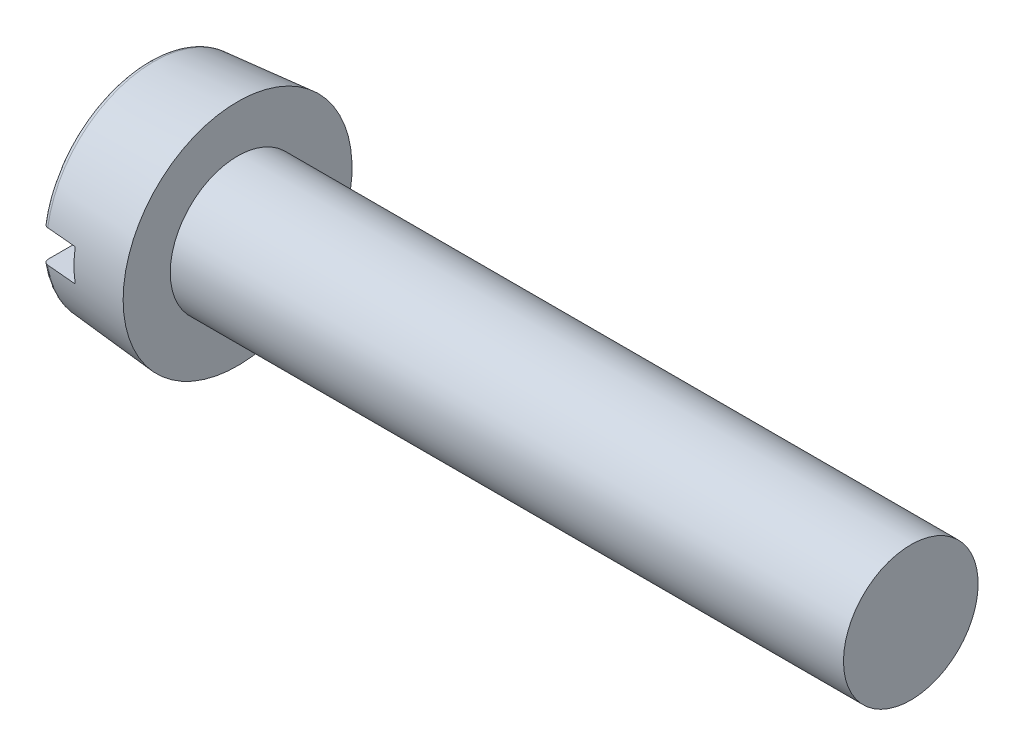
ISO-10303-21;
HEADER;
FILE_DESCRIPTION(('STEP AP214'),'2;1');
FILE_NAME('part.step','',(''),(''),'','','');
FILE_SCHEMA(('AUTOMOTIVE_DESIGN { 1 0 10303 214 1 1 1 1 }'));
ENDSEC;
DATA;
#1=APPLICATION_CONTEXT('core data for automotive mechanical design processes');
#2=APPLICATION_PROTOCOL_DEFINITION('international standard','automotive_design',2000,#1);
#3=PRODUCT_CONTEXT('',#1,'mechanical');
#4=PRODUCT('Part','Part','',(#3));
#5=PRODUCT_RELATED_PRODUCT_CATEGORY('part','',(#4));
#6=PRODUCT_DEFINITION_FORMATION('','',#4);
#7=PRODUCT_DEFINITION_CONTEXT('part definition',#1,'design');
#8=PRODUCT_DEFINITION('design','',#6,#7);
#9=PRODUCT_DEFINITION_SHAPE('','',#8);
#10=(LENGTH_UNIT() NAMED_UNIT(*) SI_UNIT(.MILLI.,.METRE.));
#11=(NAMED_UNIT(*) PLANE_ANGLE_UNIT() SI_UNIT($,.RADIAN.));
#12=(NAMED_UNIT(*) SI_UNIT($,.STERADIAN.) SOLID_ANGLE_UNIT());
#13=UNCERTAINTY_MEASURE_WITH_UNIT(LENGTH_MEASURE(1.E-05),#10,'distance_accuracy_value','');
#14=(GEOMETRIC_REPRESENTATION_CONTEXT(3) GLOBAL_UNCERTAINTY_ASSIGNED_CONTEXT((#13)) GLOBAL_UNIT_ASSIGNED_CONTEXT((#10,
#11,#12)) REPRESENTATION_CONTEXT('',''));
#15=CARTESIAN_POINT('',(0.,0.,0.));
#16=DIRECTION('',(0.,0.,1.));
#17=DIRECTION('',(1.,0.,0.));
#18=AXIS2_PLACEMENT_3D('',#15,#16,#17);
#19=CARTESIAN_POINT('',(0.,0.,0.));
#20=DIRECTION('',(-1.,0.,0.));
#21=DIRECTION('',(0.,0.,1.));
#22=AXIS2_PLACEMENT_3D('',#19,#20,#21);
#23=PLANE('',#22);
#24=DIRECTION('',(0.,0.,-1.));
#25=VECTOR('',#24,1.);
#26=CARTESIAN_POINT('',(0.,0.6,4.25));
#27=LINE('',#26,#25);
#28=CARTESIAN_POINT('',(0.,0.6,3.7300729219396));
#29=VERTEX_POINT('',#28);
#30=CARTESIAN_POINT('',(0.,0.6,-3.7300729219396));
#31=VERTEX_POINT('',#30);
#32=EDGE_CURVE('E109',#29,#31,#27,.T.);
#33=ORIENTED_EDGE('',*,*,#32,.F.);
#34=CARTESIAN_POINT('',(0.,0.,0.));
#35=DIRECTION('',(-1.,0.,0.));
#36=DIRECTION('',(0.,0.,1.));
#37=AXIS2_PLACEMENT_3D('',#34,#35,#36);
#38=CIRCLE('',#37,3.77802117556097);
#39=EDGE_CURVE('E111',#29,#31,#38,.T.);
#40=ORIENTED_EDGE('',*,*,#39,.T.);
#41=EDGE_LOOP('',(#33,#40));
#42=FACE_BOUND('',#41,.T.);
#43=ADVANCED_FACE('F40',(#42),#23,.T.);
#44=CARTESIAN_POINT('',(0.2,0.,0.));
#45=DIRECTION('',(-1.,0.,0.));
#46=DIRECTION('',(0.,0.,1.));
#47=AXIS2_PLACEMENT_3D('',#44,#45,#46);
#48=TOROIDAL_SURFACE('',#47,3.77802117556097,0.2);
#49=CARTESIAN_POINT('',(0.0612246387865015,0.6,-3.87587372657926));
#50=CARTESIAN_POINT('',(0.0692437686753912,0.6,-3.88369228056032));
#51=CARTESIAN_POINT('',(0.0779233060285452,0.6,-3.89084432861686));
#52=CARTESIAN_POINT('',(0.0963647371093723,0.6,-3.90359892074776));
#53=CARTESIAN_POINT('',(0.106127774849142,0.6,-3.90919980480116));
#54=CARTESIAN_POINT('',(0.126458056502604,0.6,-3.9186779090971));
#55=CARTESIAN_POINT('',(0.137025240149511,0.6,-3.9225552583614));
#56=CARTESIAN_POINT('',(0.158660455760603,0.6,-3.92846742757867));
#57=CARTESIAN_POINT('',(0.169728366633293,0.6,-3.93050269053124));
#58=CARTESIAN_POINT('',(0.191982910164277,0.6,-3.93266377300577));
#59=CARTESIAN_POINT('',(0.203168454374147,0.6,-3.93280080792452));
#60=CARTESIAN_POINT('',(0.22540313842355,0.6,-3.93119011051395));
#61=CARTESIAN_POINT('',(0.236452276636842,0.6,-3.92944235573598));
#62=CARTESIAN_POINT('',(0.258074076113257,0.6,-3.9241213274814));
#63=CARTESIAN_POINT('',(0.268647790704579,0.6,-3.92055233042282));
#64=CARTESIAN_POINT('',(0.289049953276454,0.6,-3.91169791603072));
#65=CARTESIAN_POINT('',(0.29887839185142,0.6,-3.90641247703967));
#66=CARTESIAN_POINT('',(0.317563075466742,0.6,-3.89425210131312));
#67=CARTESIAN_POINT('',(0.326414509930255,0.6,-3.88736977576277));
#68=CARTESIAN_POINT('',(0.342850589250194,0.6,-3.87223027231712));
#69=CARTESIAN_POINT('',(0.350435177228172,0.6,-3.86397303272459));
#70=CARTESIAN_POINT('',(0.364204576611067,0.6,-3.84623083323831));
#71=CARTESIAN_POINT('',(0.370374619979001,0.6,-3.83673441377611));
#72=CARTESIAN_POINT('',(0.381054006931012,0.6,-3.81684980557615));
#73=CARTESIAN_POINT('',(0.385563246202521,0.6,-3.80646156087472));
#74=CARTESIAN_POINT('',(0.392846737104488,0.6,-3.78495964541406));
#75=CARTESIAN_POINT('',(0.395600353250689,0.6,-3.77383898316558));
#76=CARTESIAN_POINT('',(0.399218897141943,0.6,-3.75129442345609));
#77=CARTESIAN_POINT('',(0.400083722775218,0.6,-3.7398705096345));
#78=CARTESIAN_POINT('',(0.399902741791213,0.6,-3.71694103114224));
#79=CARTESIAN_POINT('',(0.398840746719926,0.6,-3.70543559116921));
#80=CARTESIAN_POINT('',(0.394803369378344,0.6,-3.68276514513534));
#81=CARTESIAN_POINT('',(0.391827944203721,0.6,-3.67160014671402));
#82=CARTESIAN_POINT('',(0.384037460739286,0.6,-3.64991355445128));
#83=CARTESIAN_POINT('',(0.379219862757466,0.6,-3.63939287222453));
#84=CARTESIAN_POINT('',(0.367874839392101,0.6,-3.61931729960695));
#85=CARTESIAN_POINT('',(0.361347459439158,0.6,-3.60976238356411));
#86=CARTESIAN_POINT('',(0.346813106724987,0.6,-3.59196475602931));
#87=CARTESIAN_POINT('',(0.338816832744861,0.6,-3.58371331095396));
#88=CARTESIAN_POINT('',(0.321536640605144,0.6,-3.56869120707094));
#89=CARTESIAN_POINT('',(0.312252811605285,0.6,-3.56192044581347));
#90=CARTESIAN_POINT('',(0.292787711529982,0.6,-3.55014520859649));
#91=CARTESIAN_POINT('',(0.282619437412489,0.6,-3.54511924945517));
#92=CARTESIAN_POINT('',(0.261575984908415,0.6,-3.53687075764736));
#93=CARTESIAN_POINT('',(0.250700861851134,0.6,-3.5336480840162));
#94=CARTESIAN_POINT('',(0.228699522013635,0.6,-3.52913644836644));
#95=CARTESIAN_POINT('',(0.217578184290445,0.6,-3.52782367294734));
#96=CARTESIAN_POINT('',(0.195273841652058,0.6,-3.52709644901578));
#97=CARTESIAN_POINT('',(0.184090839563993,0.6,-3.52768191418516));
#98=CARTESIAN_POINT('',(0.162051417581182,0.6,-3.53072340997975));
#99=CARTESIAN_POINT('',(0.151193435259432,0.6,-3.53316814215366));
#100=CARTESIAN_POINT('',(0.130039848472246,0.6,-3.53983958577619));
#101=CARTESIAN_POINT('',(0.119744247211512,0.6,-3.5440663073782));
#102=CARTESIAN_POINT('',(0.0999656304850377,0.6,-3.55419219099659));
#103=CARTESIAN_POINT('',(0.0904856235137145,0.6,-3.56009722590129));
#104=CARTESIAN_POINT('',(0.0726372332701148,0.6,-3.57339845811737));
#105=CARTESIAN_POINT('',(0.0642689096237832,0.6,-3.58079473535911));
#106=CARTESIAN_POINT('',(0.0487797657085489,0.6,-3.59695536738271));
#107=CARTESIAN_POINT('',(0.041673965321641,0.6,-3.60573411527005));
#108=CARTESIAN_POINT('',(0.0290139060780257,0.6,-3.62434680769462));
#109=CARTESIAN_POINT('',(0.0234597605199496,0.6,-3.63418082921323));
#110=CARTESIAN_POINT('',(0.0139840285365265,0.6,-3.6547658519114));
#111=CARTESIAN_POINT('',(0.0100852096750154,0.6,-3.66552733588691));
#112=CARTESIAN_POINT('',(0.00413087259760239,0.6,-3.68754837921726));
#113=CARTESIAN_POINT('',(0.0020753916043561,0.6,-3.69880794862515));
#114=CARTESIAN_POINT('',(-0.0001485685664027,0.6,-3.72161689691355));
#115=CARTESIAN_POINT('',(-0.000299506711232251,0.6,-3.73316798931618));
#116=CARTESIAN_POINT('',(0.00133685743644255,0.6,-3.75613545547462));
#117=CARTESIAN_POINT('',(0.00312467379249925,0.6,-3.76755179268835));
#118=CARTESIAN_POINT('',(0.00859806058197772,0.6,-3.78994282374299));
#119=CARTESIAN_POINT('',(0.0122872838347024,0.6,-3.800916623506));
#120=CARTESIAN_POINT('',(0.0214659155654678,0.6,-3.82207324823008));
#121=CARTESIAN_POINT('',(0.0269531292978248,0.6,-3.83225701890213));
#122=CARTESIAN_POINT('',(0.0372850957105776,0.6,-3.84804615301513));
#123=CARTESIAN_POINT('',(0.0416441542615394,0.6,-3.85397505001525));
#124=CARTESIAN_POINT('',(0.0509821850624984,0.6,-3.86532291935009));
#125=CARTESIAN_POINT('',(0.0559611547765462,0.6,-3.87074189377065));
#126=CARTESIAN_POINT('',(0.0612246387865015,0.6,-3.87587372657926));
#127=B_SPLINE_CURVE_WITH_KNOTS('',3,(#49,#50,#51,#52,#53,#54,#55,#56,#57,#58,#59,#60,#61,#62,
#63,#64,#65,#66,#67,#68,#69,#70,#71,#72,#73,#74,#75,#76,#77,#78,#79,#80,#81,#82,#83,#84,#85,#86,
#87,#88,#89,#90,#91,#92,#93,#94,#95,#96,#97,#98,#99,#100,#101,#102,#103,#104,#105,#106,#107,
#108,#109,#110,#111,#112,#113,#114,#115,#116,#117,#118,#119,#120,#121,#122,#123,#124,#125,#126),
.UNSPECIFIED.,.T.,.F.,(4,2,2,2,2,2,2,2,2,2,2,2,2,2,2,2,2,2,2,2,2,2,2,2,2,2,2,2,2,2,2,2,2,2,2,2,
2,2,4),(0.,0.0335730171484836,0.067181825760315,0.100788118032968,0.134386326247554,
0.16778593922068,0.201185950002037,0.23450789338553,0.267830257231098,0.301309992165475,
0.334791229857928,0.368607534834798,0.402425963400057,0.43663489980734,0.470845685572107,
0.50534523014942,0.539845548327716,0.574393602495696,0.608940738780752,0.643245565962143,
0.677548018811245,0.711411743681506,0.745272821019978,0.778707975040933,0.812141608695966,
0.845373679321568,0.878605939298827,0.911955951073588,0.945307750878941,0.979033047184368,
1.01276080539804,1.04693850769677,1.08111690013278,1.11560985168408,1.15011195132798,
1.18468058187836,1.21920717190366,1.24124344818911,1.26327963433093),.UNSPECIFIED.);
#128=CARTESIAN_POINT('',(0.182568851450474,0.6,-3.93174236488051));
#129=VERTEX_POINT('',#128);
#130=EDGE_CURVE('E64',#31,#129,#127,.T.);
#131=ORIENTED_EDGE('',*,*,#130,.F.);
#132=ORIENTED_EDGE('',*,*,#39,.F.);
#133=CARTESIAN_POINT('',(0.153019204720444,0.6,3.53303185592631));
#134=CARTESIAN_POINT('',(0.163787699092,0.6,3.53039273084238));
#135=CARTESIAN_POINT('',(0.174786369480569,0.6,3.52865997691216));
#136=CARTESIAN_POINT('',(0.196927139373086,0.6,3.52706644904759));
#137=CARTESIAN_POINT('',(0.20806938646626,0.6,3.52720778568122));
#138=CARTESIAN_POINT('',(0.230166793925918,0.6,3.52936085221014));
#139=CARTESIAN_POINT('',(0.241122046646135,0.6,3.53137162989673));
#140=CARTESIAN_POINT('',(0.262537605802998,0.6,3.53719997516225));
#141=CARTESIAN_POINT('',(0.272998019743045,0.6,3.54101714830167));
#142=CARTESIAN_POINT('',(0.293156907074368,0.6,3.55035209768921));
#143=CARTESIAN_POINT('',(0.302853712802607,0.6,3.55587347320583));
#144=CARTESIAN_POINT('',(0.321195782787508,0.6,3.56844988525001));
#145=CARTESIAN_POINT('',(0.329840963247542,0.6,3.5755050438693));
#146=CARTESIAN_POINT('',(0.345933181784514,0.6,3.59102589791574));
#147=CARTESIAN_POINT('',(0.353366652206714,0.6,3.59950565727422));
#148=CARTESIAN_POINT('',(0.366727107894518,0.6,3.61757863289314));
#149=CARTESIAN_POINT('',(0.372653988326806,0.6,3.62717192656921));
#150=CARTESIAN_POINT('',(0.382915984541161,0.6,3.64733777490785));
#151=CARTESIAN_POINT('',(0.387228687602212,0.6,3.65792173686799));
#152=CARTESIAN_POINT('',(0.394036122111021,0.6,3.67965904041595));
#153=CARTESIAN_POINT('',(0.396530745128449,0.6,3.69081241592117));
#154=CARTESIAN_POINT('',(0.399652277896823,0.6,3.71349213245068));
#155=CARTESIAN_POINT('',(0.400260171320127,0.6,3.72502109478211));
#156=CARTESIAN_POINT('',(0.39953720366488,0.6,3.74801834733382));
#157=CARTESIAN_POINT('',(0.398206290301471,0.6,3.7594866359095));
#158=CARTESIAN_POINT('',(0.393633461516549,0.6,3.78206556000447));
#159=CARTESIAN_POINT('',(0.390386850559507,0.6,3.7931752457468));
#160=CARTESIAN_POINT('',(0.382064132667235,0.6,3.8146871645281));
#161=CARTESIAN_POINT('',(0.376988063245644,0.6,3.82508941206812));
#162=CARTESIAN_POINT('',(0.365177274214925,0.6,3.84482560070898));
#163=CARTESIAN_POINT('',(0.358452111344946,0.6,3.85416525859618));
#164=CARTESIAN_POINT('',(0.343513339344314,0.6,3.87156715868567));
#165=CARTESIAN_POINT('',(0.335299812917085,0.6,3.87962947181914));
#166=CARTESIAN_POINT('',(0.317712230470067,0.6,3.89415347977617));
#167=CARTESIAN_POINT('',(0.30835173547522,0.6,3.90063159470799));
#168=CARTESIAN_POINT('',(0.288666107436056,0.6,3.91190330326435));
#169=CARTESIAN_POINT('',(0.278341037742608,0.6,3.91669700741848));
#170=CARTESIAN_POINT('',(0.257144782644673,0.6,3.92440870216056));
#171=CARTESIAN_POINT('',(0.246281069204201,0.6,3.92734723639224));
#172=CARTESIAN_POINT('',(0.224213189898419,0.6,3.93134392354523));
#173=CARTESIAN_POINT('',(0.213009040493183,0.6,3.93240216723189));
#174=CARTESIAN_POINT('',(0.190664464789265,0.6,3.93260524563386));
#175=CARTESIAN_POINT('',(0.179524160616769,0.6,3.93176380416237));
#176=CARTESIAN_POINT('',(0.157543493084992,0.6,3.9282213570788));
#177=CARTESIAN_POINT('',(0.146703125545544,0.6,3.9255203773964));
#178=CARTESIAN_POINT('',(0.125633620376287,0.6,3.91834194214552));
#179=CARTESIAN_POINT('',(0.115404195642637,0.6,3.91386532869004));
#180=CARTESIAN_POINT('',(0.0958356078992517,0.6,3.90326869695395));
#181=CARTESIAN_POINT('',(0.0864964665385028,0.6,3.89714863872356));
#182=CARTESIAN_POINT('',(0.0689078244739585,0.6,3.88340020659638));
#183=CARTESIAN_POINT('',(0.0606656220467727,0.6,3.87576249873378));
#184=CARTESIAN_POINT('',(0.0455636965496512,0.6,3.85922496642767));
#185=CARTESIAN_POINT('',(0.0387040443145728,0.6,3.8503250773562));
#186=CARTESIAN_POINT('',(0.0264820753878567,0.6,3.83141338915928));
#187=CARTESIAN_POINT('',(0.0211367692801702,0.6,3.8213905975586));
#188=CARTESIAN_POINT('',(0.0121833105423785,0.6,3.80059707912202));
#189=CARTESIAN_POINT('',(0.00857526961113825,0.6,3.78982630424487));
#190=CARTESIAN_POINT('',(0.00315846688864244,0.6,3.76771337468533));
#191=CARTESIAN_POINT('',(0.00137029351318383,0.6,3.75636617446343));
#192=CARTESIAN_POINT('',(-0.000290112943638664,0.6,3.73353228057242));
#193=CARTESIAN_POINT('',(-0.000162250499358966,0.6,3.72204557997692));
#194=CARTESIAN_POINT('',(0.00201253267634337,0.6,3.69917443745036));
#195=CARTESIAN_POINT('',(0.00407276664696118,0.6,3.68779125858993));
#196=CARTESIAN_POINT('',(0.0100762356068624,0.6,3.66553285272385));
#197=CARTESIAN_POINT('',(0.0140194185135757,0.6,3.65465761167773));
#198=CARTESIAN_POINT('',(0.0236788317583957,0.6,3.63373689590963));
#199=CARTESIAN_POINT('',(0.0293934411359974,0.6,3.62369067318522));
#200=CARTESIAN_POINT('',(0.0424442621729547,0.6,3.60470884287376));
#201=CARTESIAN_POINT('',(0.0497808153060219,0.6,3.59577346977774));
#202=CARTESIAN_POINT('',(0.0658018522999086,0.6,3.57935500006869));
#203=CARTESIAN_POINT('',(0.0744744316883453,0.6,3.57186027802978));
#204=CARTESIAN_POINT('',(0.0929628353468952,0.6,3.55846476458913));
#205=CARTESIAN_POINT('',(0.102777159407983,0.6,3.55256191464308));
#206=CARTESIAN_POINT('',(0.11939976782158,0.6,3.54441833895507));
#207=CARTESIAN_POINT('',(0.125948294334595,0.6,3.54163562452137));
#208=CARTESIAN_POINT('',(0.139306080198114,0.6,3.53678837981902));
#209=CARTESIAN_POINT('',(0.146115337688668,0.6,3.53472384442823));
#210=CARTESIAN_POINT('',(0.153019204720444,0.6,3.53303185592631));
#211=B_SPLINE_CURVE_WITH_KNOTS('',3,(#133,#134,#135,#136,#137,#138,#139,#140,#141,#142,#143,
#144,#145,#146,#147,#148,#149,#150,#151,#152,#153,#154,#155,#156,#157,#158,#159,#160,#161,#162,
#163,#164,#165,#166,#167,#168,#169,#170,#171,#172,#173,#174,#175,#176,#177,#178,#179,#180,#181,
#182,#183,#184,#185,#186,#187,#188,#189,#190,#191,#192,#193,#194,#195,#196,#197,#198,#199,#200,
#201,#202,#203,#204,#205,#206,#207,#208,#209,#210),.UNSPECIFIED.,.T.,.F.,(4,2,2,2,2,2,2,2,2,2,2,
2,2,2,2,2,2,2,2,2,2,2,2,2,2,2,2,2,2,2,2,2,2,2,2,2,2,2,4),(0.,0.0332356095929416,
0.0665086517232946,0.0997647553509098,0.133013600616347,0.166333153445218,0.199655359538419,
0.233328270524307,0.267003523937312,0.301130388223696,0.33525928767045,0.369731073046334,
0.404203788058835,0.438761351648743,0.473318206664932,0.507679345757125,0.542038576099973,
0.576024948173823,0.610009089674461,0.64360997584809,0.677209239996526,0.71056655177661,
0.743923398426849,0.777264444120806,0.810606300360985,0.844159945848459,0.877715310017723,
0.911633872437314,0.945554615387104,0.979854980118833,1.01415705493097,1.04869720641275,
1.08323640256555,1.11774408613687,1.15225904166647,1.18648256602634,1.22066161935541,
1.24196969251522,1.26327761370017),.UNSPECIFIED.);
#212=CARTESIAN_POINT('',(0.182568851450481,0.6,3.93174236488095));
#213=VERTEX_POINT('',#212);
#214=EDGE_CURVE('E101',#213,#29,#211,.T.);
#215=ORIENTED_EDGE('',*,*,#214,.F.);
#216=CARTESIAN_POINT('',(0.182568851450474,0.,0.));
#217=DIRECTION('',(-1.,0.,0.));
#218=DIRECTION('',(0.,0.,1.));
#219=AXIS2_PLACEMENT_3D('',#216,#217,#218);
#220=CIRCLE('',#219,3.97726011517932);
#221=EDGE_CURVE('E115',#129,#213,#220,.F.);
#222=ORIENTED_EDGE('',*,*,#221,.F.);
#223=EDGE_LOOP('',(#131,#132,#215,#222));
#224=FACE_BOUND('',#223,.T.);
#225=ADVANCED_FACE('F187',(#224),#48,.T.);
#226=CARTESIAN_POINT('',(-25.4,0.,0.));
#227=DIRECTION('',(-1.,0.,0.));
#228=DIRECTION('',(0.,0.,1.));
#229=AXIS2_PLACEMENT_3D('',#226,#227,#228);
#230=CYLINDRICAL_SURFACE('',#229,2.5);
#231=CARTESIAN_POINT('',(28.3,0.,0.));
#232=DIRECTION('',(-1.,0.,0.));
#233=DIRECTION('',(0.,0.,1.));
#234=AXIS2_PLACEMENT_3D('',#231,#232,#233);
#235=CIRCLE('',#234,2.5);
#236=CARTESIAN_POINT('',(28.3,0.,2.5));
#237=VERTEX_POINT('',#236);
#238=EDGE_CURVE('E112',#237,#237,#235,.T.);
#239=ORIENTED_EDGE('',*,*,#238,.T.);
#240=EDGE_LOOP('',(#239));
#241=FACE_BOUND('',#240,.T.);
#242=CARTESIAN_POINT('',(3.3,0.,0.));
#243=DIRECTION('',(-1.,0.,0.));
#244=DIRECTION('',(0.,0.,1.));
#245=AXIS2_PLACEMENT_3D('',#242,#243,#244);
#246=CIRCLE('',#245,2.5);
#247=CARTESIAN_POINT('',(3.3,0.,2.5));
#248=VERTEX_POINT('',#247);
#249=EDGE_CURVE('E174',#248,#248,#246,.T.);
#250=ORIENTED_EDGE('',*,*,#249,.F.);
#251=EDGE_LOOP('',(#250));
#252=FACE_BOUND('',#251,.T.);
#253=ADVANCED_FACE('F184',(#241,#252),#230,.T.);
#254=CARTESIAN_POINT('',(28.3,2.5,0.));
#255=DIRECTION('',(1.,0.,0.));
#256=DIRECTION('',(0.,0.,-1.));
#257=AXIS2_PLACEMENT_3D('',#254,#255,#256);
#258=PLANE('',#257);
#259=ORIENTED_EDGE('',*,*,#238,.F.);
#260=EDGE_LOOP('',(#259));
#261=FACE_BOUND('',#260,.T.);
#262=ADVANCED_FACE('F186',(#261),#258,.T.);
#263=DIRECTION('',(0.,0.,1.));
#264=VECTOR('',#263,1.);
#265=CARTESIAN_POINT('',(0.,-0.599999999999999,-4.25));
#266=LINE('',#265,#264);
#267=CARTESIAN_POINT('',(0.,-0.599999999999999,-3.7300729219396));
#268=VERTEX_POINT('',#267);
#269=CARTESIAN_POINT('',(0.,-0.6,3.7300729219396));
#270=VERTEX_POINT('',#269);
#271=EDGE_CURVE('E56',#268,#270,#266,.T.);
#272=ORIENTED_EDGE('',*,*,#271,.F.);
#273=EDGE_CURVE('E107',#268,#270,#38,.T.);
#274=ORIENTED_EDGE('',*,*,#273,.T.);
#275=EDGE_LOOP('',(#272,#274));
#276=FACE_BOUND('',#275,.T.);
#277=ADVANCED_FACE('F106',(#276),#23,.T.);
#278=CARTESIAN_POINT('',(0.,0.,0.));
#279=DIRECTION('',(1.,0.,0.));
#280=DIRECTION('',(0.,0.,-1.));
#281=AXIS2_PLACEMENT_3D('',#278,#279,#280);
#282=CONICAL_SURFACE('',#281,3.96128741036445,0.0872664625997166);
#283=CARTESIAN_POINT('',(-6.6953629941866,0.6,-3.32176592464648));
#284=CARTESIAN_POINT('',(-4.63355446277594,0.6,-3.50505064447264));
#285=CARTESIAN_POINT('',(-2.5717078336292,0.6,-3.68790585738393));
#286=CARTESIAN_POINT('',(-0.116158834434021,0.6,-3.9053064156285));
#287=CARTESIAN_POINT('',(0.277517217005228,0.6,-3.94014895660471));
#288=CARTESIAN_POINT('',(3.12675511362268,0.6,-4.19224663881475));
#289=CARTESIAN_POINT('',(5.58235185834516,0.6,-4.40910750153656));
#290=CARTESIAN_POINT('',(8.0379662088826,0.6,-4.62576818100486));
#291=B_SPLINE_CURVE_WITH_KNOTS('',3,(#283,#284,#285,#286,#287,#288,#289,#290),.UNSPECIFIED.,.F.,
.F.,(4,2,2,4),(0.,6.20981701810184,7.39546178957629,14.790923493951),.UNSPECIFIED.);
#292=CARTESIAN_POINT('',(1.3,0.6,-4.03060910844025));
#293=VERTEX_POINT('',#292);
#294=EDGE_CURVE('E169',#129,#293,#291,.T.);
#295=ORIENTED_EDGE('',*,*,#294,.F.);
#296=ORIENTED_EDGE('',*,*,#221,.T.);
#297=CARTESIAN_POINT('',(8.0379662088826,0.6,4.62576818100486));
#298=CARTESIAN_POINT('',(6.81015816075401,0.6,4.51744744974704));
#299=CARTESIAN_POINT('',(5.58235534195936,0.6,4.40906739926456));
#300=CARTESIAN_POINT('',(3.12676355068113,0.6,4.1921509439523));
#301=CARTESIAN_POINT('',(1.89897457819717,0.6,4.0836145391268));
#302=CARTESIAN_POINT('',(-0.55658621496665,0.6,3.86634765198338));
#303=CARTESIAN_POINT('',(-1.7843580356463,0.6,3.75761716966308));
#304=CARTESIAN_POINT('',(-4.23987895857219,0.6,3.53989961582312));
#305=CARTESIAN_POINT('',(-5.4676280608178,0.6,3.43091254429639));
#306=CARTESIAN_POINT('',(-6.6953629941866,0.6,3.32176592464648));
#307=B_SPLINE_CURVE_WITH_KNOTS('',3,(#297,#298,#299,#300,#301,#302,#303,#304,#305,#306),
.UNSPECIFIED.,.F.,.F.,(4,2,2,2,4),(0.,3.69773091023337,7.39546171936673,11.0931925737077,
14.7909235299972),.UNSPECIFIED.);
#308=CARTESIAN_POINT('',(1.3,0.6,4.03060910844025));
#309=VERTEX_POINT('',#308);
#310=EDGE_CURVE('E165',#309,#213,#307,.T.);
#311=ORIENTED_EDGE('',*,*,#310,.F.);
#312=CARTESIAN_POINT('',(1.3,0.,0.));
#313=DIRECTION('',(-1.,0.,0.));
#314=DIRECTION('',(0.,0.,1.));
#315=AXIS2_PLACEMENT_3D('',#312,#313,#314);
#316=CIRCLE('',#315,4.07502267294815);
#317=CARTESIAN_POINT('',(1.3,-0.6,4.03060910844025));
#318=VERTEX_POINT('',#317);
#319=EDGE_CURVE('E45',#309,#318,#316,.F.);
#320=ORIENTED_EDGE('',*,*,#319,.T.);
#321=CARTESIAN_POINT('',(-6.6953629941866,-0.6,3.32176592464648));
#322=CARTESIAN_POINT('',(-4.63355446277595,-0.6,3.50505064447264));
#323=CARTESIAN_POINT('',(-2.5717078336292,-0.6,3.68790585738393));
#324=CARTESIAN_POINT('',(-0.116158834434021,-0.6,3.9053064156285));
#325=CARTESIAN_POINT('',(0.277517217005228,-0.6,3.94014895660471));
#326=CARTESIAN_POINT('',(3.12675511362268,-0.6,4.19224663881475));
#327=CARTESIAN_POINT('',(5.58235185834516,-0.6,4.40910750153656));
#328=CARTESIAN_POINT('',(8.0379662088826,-0.6,4.62576818100486));
#329=B_SPLINE_CURVE_WITH_KNOTS('',3,(#321,#322,#323,#324,#325,#326,#327,#328),.UNSPECIFIED.,.F.,
.F.,(4,2,2,4),(0.,6.20981701810184,7.39546178957629,14.790923493951),.UNSPECIFIED.);
#330=CARTESIAN_POINT('',(0.182568851450073,-0.6,3.93174236488233));
#331=VERTEX_POINT('',#330);
#332=EDGE_CURVE('E143',#331,#318,#329,.T.);
#333=ORIENTED_EDGE('',*,*,#332,.F.);
#334=CARTESIAN_POINT('',(0.182568851443687,-0.599999999999999,-3.93174236490716));
#335=VERTEX_POINT('',#334);
#336=EDGE_CURVE('E122',#331,#335,#220,.F.);
#337=ORIENTED_EDGE('',*,*,#336,.T.);
#338=CARTESIAN_POINT('',(8.0379662088826,-0.599999999999999,-4.62576818100486));
#339=CARTESIAN_POINT('',(6.81015816075401,-0.599999999999999,-4.51744744974704));
#340=CARTESIAN_POINT('',(5.58235534195936,-0.599999999999999,-4.40906739926456));
#341=CARTESIAN_POINT('',(3.12676355068113,-0.599999999999999,-4.1921509439523));
#342=CARTESIAN_POINT('',(1.89897457819717,-0.599999999999999,-4.0836145391268));
#343=CARTESIAN_POINT('',(-0.55658621496665,-0.599999999999999,-3.86634765198338));
#344=CARTESIAN_POINT('',(-1.7843580356463,-0.6,-3.75761716966308));
#345=CARTESIAN_POINT('',(-4.23987895857219,-0.6,-3.53989961582312));
#346=CARTESIAN_POINT('',(-5.4676280608178,-0.6,-3.43091254429639));
#347=CARTESIAN_POINT('',(-6.6953629941866,-0.6,-3.32176592464648));
#348=B_SPLINE_CURVE_WITH_KNOTS('',3,(#338,#339,#340,#341,#342,#343,#344,#345,#346,#347),
.UNSPECIFIED.,.F.,.F.,(4,2,2,2,4),(0.,3.69773091023337,7.39546171936673,11.0931925737077,
14.7909235299972),.UNSPECIFIED.);
#349=CARTESIAN_POINT('',(1.3,-0.599999999999999,-4.03060910844025));
#350=VERTEX_POINT('',#349);
#351=EDGE_CURVE('E96',#350,#335,#348,.T.);
#352=ORIENTED_EDGE('',*,*,#351,.F.);
#353=EDGE_CURVE('E11',#350,#293,#316,.F.);
#354=ORIENTED_EDGE('',*,*,#353,.T.);
#355=EDGE_LOOP('',(#295,#296,#311,#320,#333,#337,#352,#354));
#356=FACE_BOUND('',#355,.T.);
#357=CARTESIAN_POINT('',(3.3,0.,0.));
#358=DIRECTION('',(-1.,0.,0.));
#359=DIRECTION('',(0.,0.,1.));
#360=AXIS2_PLACEMENT_3D('',#357,#358,#359);
#361=CIRCLE('',#360,4.25);
#362=CARTESIAN_POINT('',(3.3,0.,4.25));
#363=VERTEX_POINT('',#362);
#364=EDGE_CURVE('E118',#363,#363,#361,.T.);
#365=ORIENTED_EDGE('',*,*,#364,.T.);
#366=EDGE_LOOP('',(#365));
#367=FACE_BOUND('',#366,.T.);
#368=ADVANCED_FACE('F154',(#356,#367),#282,.T.);
#369=CARTESIAN_POINT('',(3.3,2.5,0.));
#370=DIRECTION('',(-1.,0.,0.));
#371=DIRECTION('',(0.,0.,1.));
#372=AXIS2_PLACEMENT_3D('',#369,#370,#371);
#373=PLANE('',#372);
#374=ORIENTED_EDGE('',*,*,#364,.F.);
#375=EDGE_LOOP('',(#374));
#376=FACE_BOUND('',#375,.T.);
#377=ORIENTED_EDGE('',*,*,#249,.T.);
#378=EDGE_LOOP('',(#377));
#379=FACE_BOUND('',#378,.T.);
#380=ADVANCED_FACE('F158',(#376,#379),#373,.F.);
#381=CARTESIAN_POINT('',(0.0612246387865015,-0.599999999999999,-3.87587372657926));
#382=CARTESIAN_POINT('',(0.0530711976450406,-0.599999999999999,-3.86792280762262));
#383=CARTESIAN_POINT('',(0.0455887379957456,-0.599999999999999,-3.85927102386718));
#384=CARTESIAN_POINT('',(0.0321806512251617,-0.599999999999999,-3.84082362473679));
#385=CARTESIAN_POINT('',(0.0262571384681247,-0.599999999999999,-3.83102648166499));
#386=CARTESIAN_POINT('',(0.0161389190057642,-0.599999999999999,-3.81058767368617));
#387=CARTESIAN_POINT('',(0.011942585398122,-0.599999999999999,-3.79994681483285));
#388=CARTESIAN_POINT('',(0.00538206263770567,-0.599999999999999,-3.77811831933608));
#389=CARTESIAN_POINT('',(0.00301741026230065,-0.6,-3.76693082169606));
#390=CARTESIAN_POINT('',(0.000167180482523056,-0.6,-3.74423216709237));
#391=CARTESIAN_POINT('',(-0.000303940667364836,-0.6,-3.73271919340792));
#392=CARTESIAN_POINT('',(0.000683726705495547,-0.6,-3.70977556429028));
#393=CARTESIAN_POINT('',(0.00214267185113321,-0.6,-3.69834491561337));
#394=CARTESIAN_POINT('',(0.00696250177491505,-0.6,-3.675837355522));
#395=CARTESIAN_POINT('',(0.0103319544175529,-0.6,-3.66476227675151));
#396=CARTESIAN_POINT('',(0.0188891089899413,-0.6,-3.64333795432693));
#397=CARTESIAN_POINT('',(0.0240767958072676,-0.6,-3.63298870464089));
#398=CARTESIAN_POINT('',(0.036107574387182,-0.6,-3.61335493055711));
#399=CARTESIAN_POINT('',(0.0429443641765551,-0.6,-3.60406654659607));
#400=CARTESIAN_POINT('',(0.0580963458354466,-0.6,-3.58678561929948));
#401=CARTESIAN_POINT('',(0.0664114532512698,-0.6,-3.5787930019889));
#402=CARTESIAN_POINT('',(0.0841872598108014,-0.6,-3.56442741178723));
#403=CARTESIAN_POINT('',(0.0936342538579885,-0.6,-3.55803748408921));
#404=CARTESIAN_POINT('',(0.113478580170525,-0.6,-3.54695976893771));
#405=CARTESIAN_POINT('',(0.12387583768444,-0.6,-3.54227184774175));
#406=CARTESIAN_POINT('',(0.145174702216047,-0.6,-3.53479638138964));
#407=CARTESIAN_POINT('',(0.156067613717296,-0.6,-3.53198405383935));
#408=CARTESIAN_POINT('',(0.178172416916406,-0.6,-3.52824718676133));
#409=CARTESIAN_POINT('',(0.189384288443707,-0.6,-3.52732252812808));
#410=CARTESIAN_POINT('',(0.211698228430036,-0.6,-3.52738957853483));
#411=CARTESIAN_POINT('',(0.222800354286506,-0.6,-3.52836366044842));
#412=CARTESIAN_POINT('',(0.244682915641551,-0.6,-3.53216284383949));
#413=CARTESIAN_POINT('',(0.255463355811905,-0.6,-3.53498791842168));
#414=CARTESIAN_POINT('',(0.276395761222625,-0.6,-3.54240124953701));
#415=CARTESIAN_POINT('',(0.286547911619062,-0.6,-3.54698898371644));
#416=CARTESIAN_POINT('',(0.305947011219852,-0.6,-3.55778959312964));
#417=CARTESIAN_POINT('',(0.315193927562712,-0.6,-3.56400252733081));
#418=CARTESIAN_POINT('',(0.332608451007628,-0.6,-3.57793164811831));
#419=CARTESIAN_POINT('',(0.340765987545262,-0.6,-3.58566042099996));
#420=CARTESIAN_POINT('',(0.355688565917221,-0.6,-3.60236185910125));
#421=CARTESIAN_POINT('',(0.362453514055312,-0.6,-3.61133460795024));
#422=CARTESIAN_POINT('',(0.374493937007903,-0.6,-3.63039654897396));
#423=CARTESIAN_POINT('',(0.37974847924742,-0.6,-3.6404989636843));
#424=CARTESIAN_POINT('',(0.388509259811764,-0.6,-3.66143536718912));
#425=CARTESIAN_POINT('',(0.392015381019076,-0.6,-3.672269404936));
#426=CARTESIAN_POINT('',(0.397218136605891,-0.6,-3.694495858371));
#427=CARTESIAN_POINT('',(0.398893426557174,-0.6,-3.70589327430758));
#428=CARTESIAN_POINT('',(0.400316993848159,-0.6,-3.72880804529777));
#429=CARTESIAN_POINT('',(0.400065197620033,-0.6,-3.74032540491356));
#430=CARTESIAN_POINT('',(0.397633767633068,-0.6,-3.76321115664729));
#431=CARTESIAN_POINT('',(0.395444892511614,-0.599999999999999,-3.7745785692314));
#432=CARTESIAN_POINT('',(0.389183095172378,-0.599999999999999,-3.79678239965914));
#433=CARTESIAN_POINT('',(0.385110189095826,-0.599999999999999,-3.80761882205109));
#434=CARTESIAN_POINT('',(0.375206573065518,-0.599999999999999,-3.82840914801792));
#435=CARTESIAN_POINT('',(0.369382191477239,-0.599999999999999,-3.83836606457008));
#436=CARTESIAN_POINT('',(0.356128740094177,-0.599999999999999,-3.85714793934094));
#437=CARTESIAN_POINT('',(0.348699744186296,-0.599999999999999,-3.86597294965015));
#438=CARTESIAN_POINT('',(0.332524792429321,-0.599999999999999,-3.88214598632183));
#439=CARTESIAN_POINT('',(0.323792527999674,-0.599999999999999,-3.88950770349083));
#440=CARTESIAN_POINT('',(0.305203670719181,-0.599999999999999,-3.90263992696313));
#441=CARTESIAN_POINT('',(0.295347149539471,-0.599999999999999,-3.90841053461928));
#442=CARTESIAN_POINT('',(0.274913068891446,-0.599999999999999,-3.91812658059932));
#443=CARTESIAN_POINT('',(0.26434523714868,-0.599999999999999,-3.92209248094068));
#444=CARTESIAN_POINT('',(0.242690830063276,-0.599999999999999,-3.92817599531224));
#445=CARTESIAN_POINT('',(0.23160430449198,-0.599999999999999,-3.93029378629636));
#446=CARTESIAN_POINT('',(0.209331566863978,-0.599999999999999,-3.93260618794846));
#447=CARTESIAN_POINT('',(0.19814709281713,-0.599999999999999,-3.93281757285148));
#448=CARTESIAN_POINT('',(0.175899297397013,-0.599999999999999,-3.93135426522648));
#449=CARTESIAN_POINT('',(0.164836004418539,-0.599999999999999,-3.92967913981513));
#450=CARTESIAN_POINT('',(0.143171218072548,-0.599999999999999,-3.92449903651235));
#451=CARTESIAN_POINT('',(0.132568851437748,-0.599999999999999,-3.92099769829996));
#452=CARTESIAN_POINT('',(0.112108290216579,-0.599999999999999,-3.91227407425816));
#453=CARTESIAN_POINT('',(0.102249211642024,-0.599999999999999,-3.90705387364628));
#454=CARTESIAN_POINT('',(0.0872110287676747,-0.599999999999999,-3.89740723007418));
#455=CARTESIAN_POINT('',(0.0817113224276851,-0.599999999999999,-3.89347066798105));
#456=CARTESIAN_POINT('',(0.0711372053231181,-0.599999999999999,-3.88506290485178));
#457=CARTESIAN_POINT('',(0.0660627926499453,-0.599999999999999,-3.88059170621517));
#458=CARTESIAN_POINT('',(0.0612246387865015,-0.599999999999999,-3.87587372657926));
#459=B_SPLINE_CURVE_WITH_KNOTS('',3,(#381,#382,#383,#384,#385,#386,#387,#388,#389,#390,#391,
#392,#393,#394,#395,#396,#397,#398,#399,#400,#401,#402,#403,#404,#405,#406,#407,#408,#409,#410,
#411,#412,#413,#414,#415,#416,#417,#418,#419,#420,#421,#422,#423,#424,#425,#426,#427,#428,#429,
#430,#431,#432,#433,#434,#435,#436,#437,#438,#439,#440,#441,#442,#443,#444,#445,#446,#447,#448,
#449,#450,#451,#452,#453,#454,#455,#456,#457,#458),.UNSPECIFIED.,.T.,.F.,(4,2,2,2,2,2,2,2,2,2,2,
2,2,2,2,2,2,2,2,2,2,2,2,2,2,2,2,2,2,2,2,2,2,2,2,2,2,2,4),(0.,0.0341401968455438,
0.0683264613854141,0.102480450348528,0.136625799123466,0.171031342607164,0.205439678236503,
0.240003556014941,0.274567146519273,0.309000690023091,0.343432267030639,0.37748257197548,
0.411530200692048,0.445118537843212,0.478704755618664,0.51198065735664,0.545256075599677,
0.578521640466045,0.611788412480018,0.645344086982433,0.678902018442799,0.712904781164593,
0.746909821246539,0.781307208157786,0.815705908219284,0.850269606698468,0.884833009062403,
0.919272998863632,0.953711403161236,0.987810622495281,1.02190766922481,1.05560784843691,
1.08930480054903,1.12270496486462,1.15611279482627,1.18945429530178,1.22275549604403,
1.24301396896415,1.26327235096523),.UNSPECIFIED.);
#460=EDGE_CURVE('E92',#335,#268,#459,.T.);
#461=ORIENTED_EDGE('',*,*,#460,.F.);
#462=ORIENTED_EDGE('',*,*,#336,.F.);
#463=CARTESIAN_POINT('',(0.153019204720444,-0.6,3.53303185592631));
#464=CARTESIAN_POINT('',(0.142148082370038,-0.6,3.53569720437195));
#465=CARTESIAN_POINT('',(0.131495595344524,-0.6,3.53929030641704));
#466=CARTESIAN_POINT('',(0.110939588817034,-0.6,3.54822346815799));
#467=CARTESIAN_POINT('',(0.101037055827817,-0.6,3.55356578130833));
#468=CARTESIAN_POINT('',(0.0822760574086069,-0.6,3.56582832234175));
#469=CARTESIAN_POINT('',(0.0734165714495073,-0.6,3.57274698811299));
#470=CARTESIAN_POINT('',(0.056974176617633,-0.6,3.58795871518899));
#471=CARTESIAN_POINT('',(0.0493909747880666,-0.6,3.59625146021951));
#472=CARTESIAN_POINT('',(0.0356341092946748,-0.6,3.61405799922159));
#473=CARTESIAN_POINT('',(0.02947428402756,-0.6,3.62358248246681));
#474=CARTESIAN_POINT('',(0.0188174265734495,-0.6,3.6435206353182));
#475=CARTESIAN_POINT('',(0.0143205725454015,-0.6,3.65393440004865));
#476=CARTESIAN_POINT('',(0.00706069048695867,-0.6,3.67549685329834));
#477=CARTESIAN_POINT('',(0.00432031598261596,-0.6,3.68665317242949));
#478=CARTESIAN_POINT('',(0.000736734601590159,-0.6,3.70926661625918));
#479=CARTESIAN_POINT('',(-0.000106381819162778,-0.6,3.72072375527363));
#480=CARTESIAN_POINT('',(0.000128668617439613,-0.6,3.7436995109058));
#481=CARTESIAN_POINT('',(0.00122041664712545,-0.6,3.75521799179126));
#482=CARTESIAN_POINT('',(0.00532440324409333,-0.6,3.7779078836435));
#483=CARTESIAN_POINT('',(0.00833664871643932,-0.6,3.78907929336225));
#484=CARTESIAN_POINT('',(0.0161977923823216,-0.6,3.81074059808858));
#485=CARTESIAN_POINT('',(0.0210443732901439,-0.6,3.82123133347415));
#486=CARTESIAN_POINT('',(0.0324444580210644,-0.6,3.84124069366621));
#487=CARTESIAN_POINT('',(0.0389978987768885,-0.6,3.85075935437208));
#488=CARTESIAN_POINT('',(0.0535688285765214,-0.6,3.8684661736232));
#489=CARTESIAN_POINT('',(0.0615734736972094,-0.6,3.87666489880784));
#490=CARTESIAN_POINT('',(0.0788599077190476,-0.6,3.8915827163836));
#491=CARTESIAN_POINT('',(0.0881416148034482,-0.6,3.89830190349172));
#492=CARTESIAN_POINT('',(0.107602586370217,-0.6,3.90998686171255));
#493=CARTESIAN_POINT('',(0.117770129469961,-0.6,3.91497215549157));
#494=CARTESIAN_POINT('',(0.138803672662019,-0.6,3.92314528448422));
#495=CARTESIAN_POINT('',(0.149669630226148,-0.6,3.92633322902761));
#496=CARTESIAN_POINT('',(0.171675081749812,-0.6,3.93079123499017));
#497=CARTESIAN_POINT('',(0.182810771015747,-0.6,3.9320800911715));
#498=CARTESIAN_POINT('',(0.205139804716417,-0.6,3.93276074976552));
#499=CARTESIAN_POINT('',(0.216333147145262,-0.6,3.93215261773976));
#500=CARTESIAN_POINT('',(0.238407615340895,-0.6,3.92906488844595));
#501=CARTESIAN_POINT('',(0.249289906111549,-0.6,3.92659360738383));
#502=CARTESIAN_POINT('',(0.27048675881572,-0.6,3.91986380275664));
#503=CARTESIAN_POINT('',(0.28080131895558,-0.6,3.91560527354539));
#504=CARTESIAN_POINT('',(0.300601566750023,-0.6,3.90541403150658));
#505=CARTESIAN_POINT('',(0.310084979047476,-0.6,3.89947690001495));
#506=CARTESIAN_POINT('',(0.327931550695381,-0.6,3.886107698849));
#507=CARTESIAN_POINT('',(0.336294667500082,-0.6,3.87867557242568));
#508=CARTESIAN_POINT('',(0.351743026842764,-0.6,3.8624598355582));
#509=CARTESIAN_POINT('',(0.358816483987258,-0.6,3.85366499979789));
#510=CARTESIAN_POINT('',(0.371406462125119,-0.6,3.83502400573598));
#511=CARTESIAN_POINT('',(0.376922889983502,-0.6,3.82517778459342));
#512=CARTESIAN_POINT('',(0.386309477402571,-0.6,3.80459178782986));
#513=CARTESIAN_POINT('',(0.390159874712582,-0.6,3.79384300067918));
#514=CARTESIAN_POINT('',(0.396021302026687,-0.6,3.77185509142601));
#515=CARTESIAN_POINT('',(0.398032224964019,-0.6,3.76061594082176));
#516=CARTESIAN_POINT('',(0.400174511667982,-0.6,3.73784770991462));
#517=CARTESIAN_POINT('',(0.400287131146233,-0.6,3.72631686299022));
#518=CARTESIAN_POINT('',(0.398583054839335,-0.6,3.70339834122956));
#519=CARTESIAN_POINT('',(0.396766288647614,-0.6,3.69201067163343));
#520=CARTESIAN_POINT('',(0.391241265740662,-0.6,3.66965712636948));
#521=CARTESIAN_POINT('',(0.387525807602375,-0.6,3.65869302878918));
#522=CARTESIAN_POINT('',(0.378298817097428,-0.6,3.63754813474546));
#523=CARTESIAN_POINT('',(0.372787301822853,-0.6,3.62736733082901));
#524=CARTESIAN_POINT('',(0.360146330860108,-0.6,3.60813093660493));
#525=CARTESIAN_POINT('',(0.35302431874493,-0.6,3.59907045725468));
#526=CARTESIAN_POINT('',(0.337344289880186,-0.6,3.58229160760495));
#527=CARTESIAN_POINT('',(0.328786414121361,-0.6,3.57457310568502));
#528=CARTESIAN_POINT('',(0.310582894146802,-0.6,3.56079494385427));
#529=CARTESIAN_POINT('',(0.3009510993505,-0.6,3.55471698829212));
#530=CARTESIAN_POINT('',(0.280790303105255,-0.6,3.54428845409056));
#531=CARTESIAN_POINT('',(0.270261144607211,-0.6,3.53993817857243));
#532=CARTESIAN_POINT('',(0.248754439258769,-0.6,3.5331481021966));
#533=CARTESIAN_POINT('',(0.237784419368727,-0.6,3.53068440364265));
#534=CARTESIAN_POINT('',(0.215594997368117,-0.6,3.52765529508555));
#535=CARTESIAN_POINT('',(0.20437593810668,-0.6,3.52708742070228));
#536=CARTESIAN_POINT('',(0.186428095080726,-0.6,3.52770601240141));
#537=CARTESIAN_POINT('',(0.179672949929194,-0.6,3.52828906112183));
#538=CARTESIAN_POINT('',(0.16625824345622,-0.6,3.53014541793571));
#539=CARTESIAN_POINT('',(0.159598681304683,-0.6,3.53141872003089));
#540=CARTESIAN_POINT('',(0.153019204720444,-0.6,3.53303185592631));
#541=B_SPLINE_CURVE_WITH_KNOTS('',3,(#463,#464,#465,#466,#467,#468,#469,#470,#471,#472,#473,
#474,#475,#476,#477,#478,#479,#480,#481,#482,#483,#484,#485,#486,#487,#488,#489,#490,#491,#492,
#493,#494,#495,#496,#497,#498,#499,#500,#501,#502,#503,#504,#505,#506,#507,#508,#509,#510,#511,
#512,#513,#514,#515,#516,#517,#518,#519,#520,#521,#522,#523,#524,#525,#526,#527,#528,#529,#530,
#531,#532,#533,#534,#535,#536,#537,#538,#539,#540),.UNSPECIFIED.,.T.,.F.,(4,2,2,2,2,2,2,2,2,2,2,
2,2,2,2,2,2,2,2,2,2,2,2,2,2,2,2,2,2,2,2,2,2,2,2,2,2,2,4),(0.,0.03355420278206,
0.0671518036103653,0.100716254062286,0.134272989630208,0.168143400043938,0.202017438042802,
0.236320001494692,0.270624200361697,0.305170141268265,0.339716206383942,0.374218774907536,
0.408720068766236,0.442929721904798,0.477137184374032,0.510945973206089,0.544752705284099,
0.57822256013881,0.611691258259122,0.64501144609401,0.678331739192908,0.711740572823163,
0.74515067486986,0.778852263467313,0.812555867525901,0.846648975213952,0.880744067167975,
0.915175626898701,0.949608443138903,0.984172837487771,1.01873690291593,1.05314436822513,
1.08754845696157,1.1215513259265,1.15556015805796,1.18913072063336,1.22265762783818,
1.24296565150418,1.26327349869708),.UNSPECIFIED.);
#542=EDGE_CURVE('E102',#270,#331,#541,.T.);
#543=ORIENTED_EDGE('',*,*,#542,.F.);
#544=ORIENTED_EDGE('',*,*,#273,.F.);
#545=EDGE_LOOP('',(#461,#462,#543,#544));
#546=FACE_BOUND('',#545,.T.);
#547=ADVANCED_FACE('F42',(#546),#48,.T.);
#548=CARTESIAN_POINT('',(1.3,0.6,4.25));
#549=DIRECTION('',(0.,1.,0.));
#550=DIRECTION('',(0.,0.,1.));
#551=AXIS2_PLACEMENT_3D('',#548,#549,#550);
#552=PLANE('',#551);
#553=ORIENTED_EDGE('',*,*,#294,.T.);
#554=DIRECTION('',(0.,0.,-1.));
#555=VECTOR('',#554,1.);
#556=CARTESIAN_POINT('',(1.3,0.6,4.25));
#557=LINE('',#556,#555);
#558=EDGE_CURVE('E108',#309,#293,#557,.T.);
#559=ORIENTED_EDGE('',*,*,#558,.F.);
#560=ORIENTED_EDGE('',*,*,#310,.T.);
#561=ORIENTED_EDGE('',*,*,#214,.T.);
#562=ORIENTED_EDGE('',*,*,#32,.T.);
#563=ORIENTED_EDGE('',*,*,#130,.T.);
#564=EDGE_LOOP('',(#553,#559,#560,#561,#562,#563));
#565=FACE_BOUND('',#564,.T.);
#566=ADVANCED_FACE('F135',(#565),#552,.F.);
#567=CARTESIAN_POINT('',(1.3,-0.599999999999999,-4.25));
#568=DIRECTION('',(0.,-1.,0.));
#569=DIRECTION('',(0.,0.,-1.));
#570=AXIS2_PLACEMENT_3D('',#567,#568,#569);
#571=PLANE('',#570);
#572=ORIENTED_EDGE('',*,*,#351,.T.);
#573=ORIENTED_EDGE('',*,*,#460,.T.);
#574=ORIENTED_EDGE('',*,*,#271,.T.);
#575=ORIENTED_EDGE('',*,*,#542,.T.);
#576=ORIENTED_EDGE('',*,*,#332,.T.);
#577=DIRECTION('',(0.,0.,1.));
#578=VECTOR('',#577,1.);
#579=CARTESIAN_POINT('',(1.3,-0.599999999999999,-4.25));
#580=LINE('',#579,#578);
#581=EDGE_CURVE('E148',#350,#318,#580,.T.);
#582=ORIENTED_EDGE('',*,*,#581,.F.);
#583=EDGE_LOOP('',(#572,#573,#574,#575,#576,#582));
#584=FACE_BOUND('',#583,.T.);
#585=ADVANCED_FACE('F93',(#584),#571,.F.);
#586=CARTESIAN_POINT('',(1.3,0.6,-4.25));
#587=DIRECTION('',(-1.,0.,0.));
#588=DIRECTION('',(0.,0.,1.));
#589=AXIS2_PLACEMENT_3D('',#586,#587,#588);
#590=PLANE('',#589);
#591=ORIENTED_EDGE('',*,*,#581,.T.);
#592=ORIENTED_EDGE('',*,*,#319,.F.);
#593=ORIENTED_EDGE('',*,*,#558,.T.);
#594=ORIENTED_EDGE('',*,*,#353,.F.);
#595=EDGE_LOOP('',(#591,#592,#593,#594));
#596=FACE_BOUND('',#595,.T.);
#597=ADVANCED_FACE('F134',(#596),#590,.T.);
#598=CLOSED_SHELL('',(#43,#225,#253,#262,#277,#368,#380,#547,#566,#585,#597));
#599=MANIFOLD_SOLID_BREP('B2',#598);
#600=ADVANCED_BREP_SHAPE_REPRESENTATION('',(#18,#599),#14);
#601=SHAPE_DEFINITION_REPRESENTATION(#9,#600);
ENDSEC;
END-ISO-10303-21;
